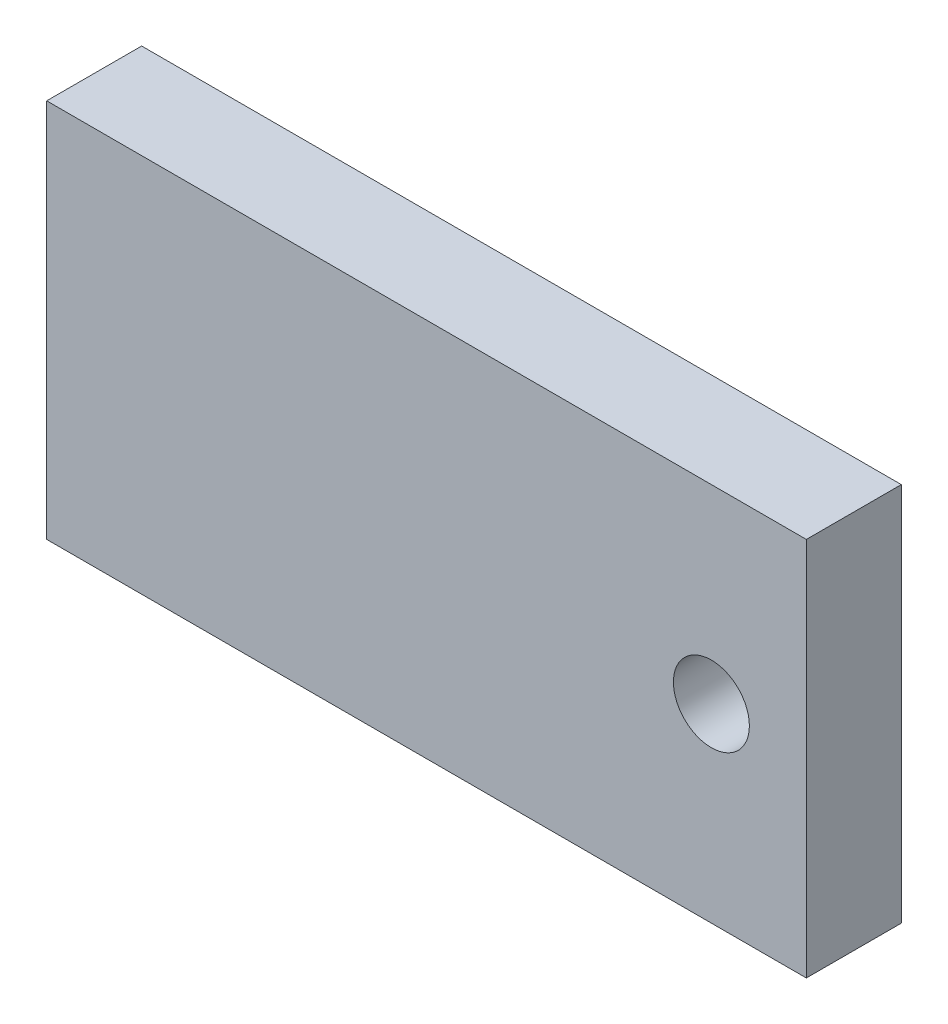
ISO-10303-21;
HEADER;
FILE_DESCRIPTION(('STEP AP214'),'2;1');
FILE_NAME('part.step','',(''),(''),'','','');
FILE_SCHEMA(('AUTOMOTIVE_DESIGN { 1 0 10303 214 1 1 1 1 }'));
ENDSEC;
DATA;
#1=APPLICATION_CONTEXT('core data for automotive mechanical design processes');
#2=APPLICATION_PROTOCOL_DEFINITION('international standard','automotive_design',2000,#1);
#3=PRODUCT_CONTEXT('',#1,'mechanical');
#4=PRODUCT('Part','Part','',(#3));
#5=PRODUCT_RELATED_PRODUCT_CATEGORY('part','',(#4));
#6=PRODUCT_DEFINITION_FORMATION('','',#4);
#7=PRODUCT_DEFINITION_CONTEXT('part definition',#1,'design');
#8=PRODUCT_DEFINITION('design','',#6,#7);
#9=PRODUCT_DEFINITION_SHAPE('','',#8);
#10=(LENGTH_UNIT() NAMED_UNIT(*) SI_UNIT(.MILLI.,.METRE.));
#11=(NAMED_UNIT(*) PLANE_ANGLE_UNIT() SI_UNIT($,.RADIAN.));
#12=(NAMED_UNIT(*) SI_UNIT($,.STERADIAN.) SOLID_ANGLE_UNIT());
#13=UNCERTAINTY_MEASURE_WITH_UNIT(LENGTH_MEASURE(1.E-05),#10,'distance_accuracy_value','');
#14=(GEOMETRIC_REPRESENTATION_CONTEXT(3) GLOBAL_UNCERTAINTY_ASSIGNED_CONTEXT((#13)) GLOBAL_UNIT_ASSIGNED_CONTEXT((#10,
#11,#12)) REPRESENTATION_CONTEXT('',''));
#15=CARTESIAN_POINT('',(0.,0.,0.));
#16=DIRECTION('',(0.,0.,1.));
#17=DIRECTION('',(1.,0.,0.));
#18=AXIS2_PLACEMENT_3D('',#15,#16,#17);
#19=CARTESIAN_POINT('',(0.,0.,5.));
#20=DIRECTION('',(0.,0.,1.));
#21=DIRECTION('',(1.,0.,0.));
#22=AXIS2_PLACEMENT_3D('',#19,#20,#21);
#23=PLANE('',#22);
#24=DIRECTION('',(-1.,0.,0.));
#25=VECTOR('',#24,1.);
#26=CARTESIAN_POINT('',(10.6993238445632,22.6111721998938,5.));
#27=LINE('',#26,#25);
#28=CARTESIAN_POINT('',(10.6993238445632,22.6111721998938,5.));
#29=VERTEX_POINT('',#28);
#30=CARTESIAN_POINT('',(-29.3006761554368,22.6111721998938,5.));
#31=VERTEX_POINT('',#30);
#32=EDGE_CURVE('E86',#29,#31,#27,.T.);
#33=ORIENTED_EDGE('',*,*,#32,.T.);
#34=DIRECTION('',(0.,-1.,0.));
#35=VECTOR('',#34,1.);
#36=CARTESIAN_POINT('',(-29.3006761554368,22.6111721998938,5.));
#37=LINE('',#36,#35);
#38=CARTESIAN_POINT('',(-29.3006761554368,2.61117219989384,5.));
#39=VERTEX_POINT('',#38);
#40=EDGE_CURVE('E81',#31,#39,#37,.T.);
#41=ORIENTED_EDGE('',*,*,#40,.T.);
#42=DIRECTION('',(1.,0.,0.));
#43=VECTOR('',#42,1.);
#44=CARTESIAN_POINT('',(-29.3006761554368,2.61117219989384,5.));
#45=LINE('',#44,#43);
#46=CARTESIAN_POINT('',(10.6993238445632,2.61117219989384,5.));
#47=VERTEX_POINT('',#46);
#48=EDGE_CURVE('E84',#39,#47,#45,.T.);
#49=ORIENTED_EDGE('',*,*,#48,.T.);
#50=DIRECTION('',(0.,1.,0.));
#51=VECTOR('',#50,1.);
#52=CARTESIAN_POINT('',(10.6993238445632,2.61117219989384,5.));
#53=LINE('',#52,#51);
#54=EDGE_CURVE('E52',#47,#29,#53,.T.);
#55=ORIENTED_EDGE('',*,*,#54,.T.);
#56=EDGE_LOOP('',(#33,#41,#49,#55));
#57=FACE_BOUND('',#56,.T.);
#58=CARTESIAN_POINT('',(5.69932384456323,12.6111721998938,5.));
#59=DIRECTION('',(0.,0.,1.));
#60=DIRECTION('',(1.,0.,0.));
#61=AXIS2_PLACEMENT_3D('',#58,#59,#60);
#62=CIRCLE('',#61,2.);
#63=CARTESIAN_POINT('',(7.69932384456323,12.6111721998938,5.));
#64=VERTEX_POINT('',#63);
#65=EDGE_CURVE('E102',#64,#64,#62,.T.);
#66=ORIENTED_EDGE('',*,*,#65,.F.);
#67=EDGE_LOOP('',(#66));
#68=FACE_BOUND('',#67,.T.);
#69=ADVANCED_FACE('F35',(#57,#68),#23,.T.);
#70=CARTESIAN_POINT('',(0.,0.,0.));
#71=DIRECTION('',(0.,0.,1.));
#72=DIRECTION('',(1.,0.,0.));
#73=AXIS2_PLACEMENT_3D('',#70,#71,#72);
#74=PLANE('',#73);
#75=DIRECTION('',(-1.,0.,0.));
#76=VECTOR('',#75,1.);
#77=CARTESIAN_POINT('',(10.6993238445632,22.6111721998938,0.));
#78=LINE('',#77,#76);
#79=CARTESIAN_POINT('',(10.6993238445632,22.6111721998938,0.));
#80=VERTEX_POINT('',#79);
#81=CARTESIAN_POINT('',(-29.3006761554368,22.6111721998938,0.));
#82=VERTEX_POINT('',#81);
#83=EDGE_CURVE('E99',#80,#82,#78,.T.);
#84=ORIENTED_EDGE('',*,*,#83,.F.);
#85=DIRECTION('',(0.,1.,0.));
#86=VECTOR('',#85,1.);
#87=CARTESIAN_POINT('',(10.6993238445632,2.61117219989384,0.));
#88=LINE('',#87,#86);
#89=CARTESIAN_POINT('',(10.6993238445632,2.61117219989384,0.));
#90=VERTEX_POINT('',#89);
#91=EDGE_CURVE('E74',#90,#80,#88,.T.);
#92=ORIENTED_EDGE('',*,*,#91,.F.);
#93=DIRECTION('',(1.,0.,0.));
#94=VECTOR('',#93,1.);
#95=CARTESIAN_POINT('',(0.699323844563227,2.61117219989384,0.));
#96=LINE('',#95,#94);
#97=CARTESIAN_POINT('',(-29.3006761554368,2.61117219989384,0.));
#98=VERTEX_POINT('',#97);
#99=EDGE_CURVE('E68',#98,#90,#96,.T.);
#100=ORIENTED_EDGE('',*,*,#99,.F.);
#101=DIRECTION('',(0.,-1.,0.));
#102=VECTOR('',#101,1.);
#103=CARTESIAN_POINT('',(-29.3006761554368,22.6111721998938,0.));
#104=LINE('',#103,#102);
#105=EDGE_CURVE('E91',#82,#98,#104,.T.);
#106=ORIENTED_EDGE('',*,*,#105,.F.);
#107=EDGE_LOOP('',(#84,#92,#100,#106));
#108=FACE_BOUND('',#107,.T.);
#109=CARTESIAN_POINT('',(5.69932384456323,12.6111721998938,0.));
#110=DIRECTION('',(0.,0.,1.));
#111=DIRECTION('',(1.,0.,0.));
#112=AXIS2_PLACEMENT_3D('',#109,#110,#111);
#113=CIRCLE('',#112,2.);
#114=CARTESIAN_POINT('',(7.69932384456323,12.6111721998938,0.));
#115=VERTEX_POINT('',#114);
#116=EDGE_CURVE('E114',#115,#115,#113,.T.);
#117=ORIENTED_EDGE('',*,*,#116,.T.);
#118=EDGE_LOOP('',(#117));
#119=FACE_BOUND('',#118,.T.);
#120=ADVANCED_FACE('F110',(#108,#119),#74,.F.);
#121=CARTESIAN_POINT('',(10.6993238445632,22.6111721998938,5.));
#122=DIRECTION('',(0.,-1.,0.));
#123=DIRECTION('',(0.,0.,-1.));
#124=AXIS2_PLACEMENT_3D('',#121,#122,#123);
#125=PLANE('',#124);
#126=ORIENTED_EDGE('',*,*,#83,.T.);
#127=DIRECTION('',(0.,0.,-1.));
#128=VECTOR('',#127,1.);
#129=CARTESIAN_POINT('',(-29.3006761554368,22.6111721998938,5.));
#130=LINE('',#129,#128);
#131=EDGE_CURVE('E11',#31,#82,#130,.T.);
#132=ORIENTED_EDGE('',*,*,#131,.F.);
#133=ORIENTED_EDGE('',*,*,#32,.F.);
#134=DIRECTION('',(0.,0.,-1.));
#135=VECTOR('',#134,1.);
#136=CARTESIAN_POINT('',(10.6993238445632,22.6111721998938,5.));
#137=LINE('',#136,#135);
#138=EDGE_CURVE('E95',#29,#80,#137,.T.);
#139=ORIENTED_EDGE('',*,*,#138,.T.);
#140=EDGE_LOOP('',(#126,#132,#133,#139));
#141=FACE_BOUND('',#140,.T.);
#142=ADVANCED_FACE('F37',(#141),#125,.F.);
#143=CARTESIAN_POINT('',(-29.3006761554368,22.6111721998938,5.));
#144=DIRECTION('',(1.,0.,0.));
#145=DIRECTION('',(0.,0.,-1.));
#146=AXIS2_PLACEMENT_3D('',#143,#144,#145);
#147=PLANE('',#146);
#148=ORIENTED_EDGE('',*,*,#105,.T.);
#149=DIRECTION('',(0.,0.,-1.));
#150=VECTOR('',#149,1.);
#151=CARTESIAN_POINT('',(-29.3006761554368,2.61117219989384,5.));
#152=LINE('',#151,#150);
#153=EDGE_CURVE('E44',#39,#98,#152,.T.);
#154=ORIENTED_EDGE('',*,*,#153,.F.);
#155=ORIENTED_EDGE('',*,*,#40,.F.);
#156=ORIENTED_EDGE('',*,*,#131,.T.);
#157=EDGE_LOOP('',(#148,#154,#155,#156));
#158=FACE_BOUND('',#157,.T.);
#159=ADVANCED_FACE('F90',(#158),#147,.F.);
#160=CARTESIAN_POINT('',(0.699323844563227,2.61117219989384,5.));
#161=DIRECTION('',(0.,1.,0.));
#162=DIRECTION('',(0.,0.,1.));
#163=AXIS2_PLACEMENT_3D('',#160,#161,#162);
#164=PLANE('',#163);
#165=ORIENTED_EDGE('',*,*,#99,.T.);
#166=DIRECTION('',(0.,0.,-1.));
#167=VECTOR('',#166,1.);
#168=CARTESIAN_POINT('',(10.6993238445632,2.61117219989384,5.));
#169=LINE('',#168,#167);
#170=EDGE_CURVE('E92',#47,#90,#169,.T.);
#171=ORIENTED_EDGE('',*,*,#170,.F.);
#172=ORIENTED_EDGE('',*,*,#48,.F.);
#173=ORIENTED_EDGE('',*,*,#153,.T.);
#174=EDGE_LOOP('',(#165,#171,#172,#173));
#175=FACE_BOUND('',#174,.T.);
#176=ADVANCED_FACE('F93',(#175),#164,.F.);
#177=CARTESIAN_POINT('',(10.6993238445632,2.61117219989384,5.));
#178=DIRECTION('',(-1.,0.,0.));
#179=DIRECTION('',(0.,0.,1.));
#180=AXIS2_PLACEMENT_3D('',#177,#178,#179);
#181=PLANE('',#180);
#182=ORIENTED_EDGE('',*,*,#91,.T.);
#183=ORIENTED_EDGE('',*,*,#138,.F.);
#184=ORIENTED_EDGE('',*,*,#54,.F.);
#185=ORIENTED_EDGE('',*,*,#170,.T.);
#186=EDGE_LOOP('',(#182,#183,#184,#185));
#187=FACE_BOUND('',#186,.T.);
#188=ADVANCED_FACE('F107',(#187),#181,.F.);
#189=CARTESIAN_POINT('',(5.69932384456323,12.6111721998938,5.));
#190=DIRECTION('',(0.,0.,-1.));
#191=DIRECTION('',(-1.,0.,0.));
#192=AXIS2_PLACEMENT_3D('',#189,#190,#191);
#193=CYLINDRICAL_SURFACE('',#192,2.);
#194=ORIENTED_EDGE('',*,*,#65,.T.);
#195=EDGE_LOOP('',(#194));
#196=FACE_BOUND('',#195,.T.);
#197=ORIENTED_EDGE('',*,*,#116,.F.);
#198=EDGE_LOOP('',(#197));
#199=FACE_BOUND('',#198,.T.);
#200=ADVANCED_FACE('F120',(#196,#199),#193,.F.);
#201=CLOSED_SHELL('',(#69,#120,#142,#159,#176,#188,#200));
#202=MANIFOLD_SOLID_BREP('B2',#201);
#203=ADVANCED_BREP_SHAPE_REPRESENTATION('',(#18,#202),#14);
#204=SHAPE_DEFINITION_REPRESENTATION(#9,#203);
ENDSEC;
END-ISO-10303-21;
